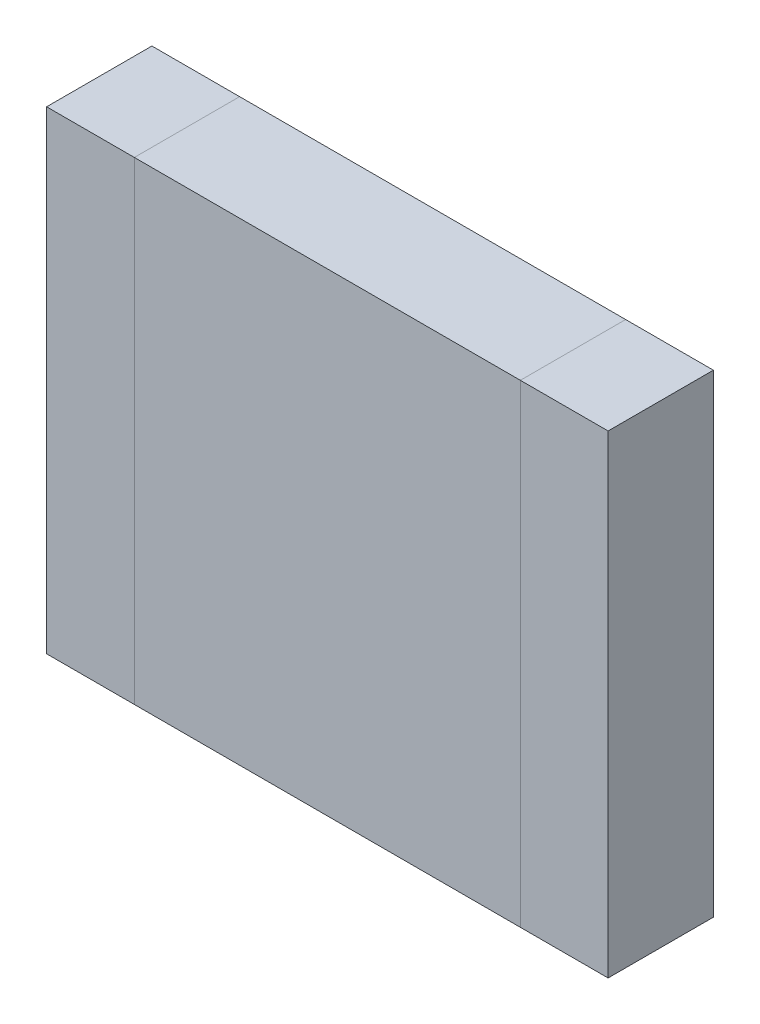
ISO-10303-21;
HEADER;
FILE_DESCRIPTION(('STEP AP214'),'2;1');
FILE_NAME('part.step','',(''),(''),'','','');
FILE_SCHEMA(('AUTOMOTIVE_DESIGN { 1 0 10303 214 1 1 1 1 }'));
ENDSEC;
DATA;
#1=APPLICATION_CONTEXT('core data for automotive mechanical design processes');
#2=APPLICATION_PROTOCOL_DEFINITION('international standard','automotive_design',2000,#1);
#3=PRODUCT_CONTEXT('',#1,'mechanical');
#4=PRODUCT('Part','Part','',(#3));
#5=PRODUCT_RELATED_PRODUCT_CATEGORY('part','',(#4));
#6=PRODUCT_DEFINITION_FORMATION('','',#4);
#7=PRODUCT_DEFINITION_CONTEXT('part definition',#1,'design');
#8=PRODUCT_DEFINITION('design','',#6,#7);
#9=PRODUCT_DEFINITION_SHAPE('','',#8);
#10=(LENGTH_UNIT() NAMED_UNIT(*) SI_UNIT(.MILLI.,.METRE.));
#11=(NAMED_UNIT(*) PLANE_ANGLE_UNIT() SI_UNIT($,.RADIAN.));
#12=(NAMED_UNIT(*) SI_UNIT($,.STERADIAN.) SOLID_ANGLE_UNIT());
#13=UNCERTAINTY_MEASURE_WITH_UNIT(LENGTH_MEASURE(1.E-05),#10,'distance_accuracy_value','');
#14=(GEOMETRIC_REPRESENTATION_CONTEXT(3) GLOBAL_UNCERTAINTY_ASSIGNED_CONTEXT((#13)) GLOBAL_UNIT_ASSIGNED_CONTEXT((#10,
#11,#12)) REPRESENTATION_CONTEXT('',''));
#15=CARTESIAN_POINT('',(0.,0.,0.));
#16=DIRECTION('',(0.,0.,1.));
#17=DIRECTION('',(1.,0.,0.));
#18=AXIS2_PLACEMENT_3D('',#15,#16,#17);
#19=CARTESIAN_POINT('',(1.0999978,1.34999984,0.));
#20=DIRECTION('',(1.,0.,0.));
#21=DIRECTION('',(0.,-1.,0.));
#22=AXIS2_PLACEMENT_3D('',#19,#20,#21);
#23=PLANE('',#22);
#24=DIRECTION('',(0.,-1.,0.));
#25=VECTOR('',#24,1.);
#26=CARTESIAN_POINT('',(1.0999978,1.34999984,0.));
#27=LINE('',#26,#25);
#28=CARTESIAN_POINT('',(1.0999978,1.34999984,0.));
#29=VERTEX_POINT('',#28);
#30=CARTESIAN_POINT('',(1.0999978,-1.34999984,0.));
#31=VERTEX_POINT('',#30);
#32=EDGE_CURVE('P0_E11',#29,#31,#27,.T.);
#33=ORIENTED_EDGE('',*,*,#32,.T.);
#34=DIRECTION('',(0.,0.,1.));
#35=VECTOR('',#34,1.);
#36=CARTESIAN_POINT('',(1.0999978,-1.34999984,0.));
#37=LINE('',#36,#35);
#38=CARTESIAN_POINT('',(1.0999978,-1.34999984,0.5999988));
#39=VERTEX_POINT('',#38);
#40=EDGE_CURVE('P0_E24',#31,#39,#37,.T.);
#41=ORIENTED_EDGE('',*,*,#40,.T.);
#42=DIRECTION('',(0.,-1.,0.));
#43=VECTOR('',#42,1.);
#44=CARTESIAN_POINT('',(1.0999978,1.34999984,0.5999988));
#45=LINE('',#44,#43);
#46=CARTESIAN_POINT('',(1.0999978,1.34999984,0.5999988));
#47=VERTEX_POINT('',#46);
#48=EDGE_CURVE('P0_E87',#47,#39,#45,.T.);
#49=ORIENTED_EDGE('',*,*,#48,.F.);
#50=DIRECTION('',(0.,0.,1.));
#51=VECTOR('',#50,1.);
#52=CARTESIAN_POINT('',(1.0999978,1.34999984,0.));
#53=LINE('',#52,#51);
#54=EDGE_CURVE('P0_E36',#29,#47,#53,.T.);
#55=ORIENTED_EDGE('',*,*,#54,.F.);
#56=EDGE_LOOP('',(#33,#41,#49,#55));
#57=FACE_BOUND('',#56,.T.);
#58=ADVANCED_FACE('P0_F17',(#57),#23,.F.);
#59=CARTESIAN_POINT('',(1.0999978,-1.34999984,0.));
#60=DIRECTION('',(0.,1.,0.));
#61=DIRECTION('',(1.,0.,0.));
#62=AXIS2_PLACEMENT_3D('',#59,#60,#61);
#63=PLANE('',#62);
#64=DIRECTION('',(1.,0.,0.));
#65=VECTOR('',#64,1.);
#66=CARTESIAN_POINT('',(1.0999978,-1.34999984,0.));
#67=LINE('',#66,#65);
#68=CARTESIAN_POINT('',(1.59999934,-1.34999984,0.));
#69=VERTEX_POINT('',#68);
#70=EDGE_CURVE('P0_E84',#31,#69,#67,.T.);
#71=ORIENTED_EDGE('',*,*,#70,.T.);
#72=DIRECTION('',(0.,0.,1.));
#73=VECTOR('',#72,1.);
#74=CARTESIAN_POINT('',(1.59999934,-1.34999984,0.));
#75=LINE('',#74,#73);
#76=CARTESIAN_POINT('',(1.59999934,-1.34999984,0.5999988));
#77=VERTEX_POINT('',#76);
#78=EDGE_CURVE('P0_E82',#69,#77,#75,.T.);
#79=ORIENTED_EDGE('',*,*,#78,.T.);
#80=DIRECTION('',(1.,0.,0.));
#81=VECTOR('',#80,1.);
#82=CARTESIAN_POINT('',(1.0999978,-1.34999984,0.5999988));
#83=LINE('',#82,#81);
#84=EDGE_CURVE('P0_E62',#39,#77,#83,.T.);
#85=ORIENTED_EDGE('',*,*,#84,.F.);
#86=ORIENTED_EDGE('',*,*,#40,.F.);
#87=EDGE_LOOP('',(#71,#79,#85,#86));
#88=FACE_BOUND('',#87,.T.);
#89=ADVANCED_FACE('P0_F89',(#88),#63,.F.);
#90=CARTESIAN_POINT('',(1.59999934,-1.34999984,0.));
#91=DIRECTION('',(-1.,0.,0.));
#92=DIRECTION('',(0.,1.,0.));
#93=AXIS2_PLACEMENT_3D('',#90,#91,#92);
#94=PLANE('',#93);
#95=DIRECTION('',(0.,1.,0.));
#96=VECTOR('',#95,1.);
#97=CARTESIAN_POINT('',(1.59999934,-1.34999984,0.));
#98=LINE('',#97,#96);
#99=CARTESIAN_POINT('',(1.59999934,1.34999984,0.));
#100=VERTEX_POINT('',#99);
#101=EDGE_CURVE('P0_E71',#69,#100,#98,.T.);
#102=ORIENTED_EDGE('',*,*,#101,.T.);
#103=DIRECTION('',(0.,0.,1.));
#104=VECTOR('',#103,1.);
#105=CARTESIAN_POINT('',(1.59999934,1.34999984,0.));
#106=LINE('',#105,#104);
#107=CARTESIAN_POINT('',(1.59999934,1.34999984,0.5999988));
#108=VERTEX_POINT('',#107);
#109=EDGE_CURVE('P0_E65',#100,#108,#106,.T.);
#110=ORIENTED_EDGE('',*,*,#109,.T.);
#111=DIRECTION('',(0.,1.,0.));
#112=VECTOR('',#111,1.);
#113=CARTESIAN_POINT('',(1.59999934,-1.34999984,0.5999988));
#114=LINE('',#113,#112);
#115=EDGE_CURVE('P0_E57',#77,#108,#114,.T.);
#116=ORIENTED_EDGE('',*,*,#115,.F.);
#117=ORIENTED_EDGE('',*,*,#78,.F.);
#118=EDGE_LOOP('',(#102,#110,#116,#117));
#119=FACE_BOUND('',#118,.T.);
#120=ADVANCED_FACE('P0_F69',(#119),#94,.F.);
#121=CARTESIAN_POINT('',(1.59999934,1.34999984,0.));
#122=DIRECTION('',(0.,-1.,0.));
#123=DIRECTION('',(-1.,0.,0.));
#124=AXIS2_PLACEMENT_3D('',#121,#122,#123);
#125=PLANE('',#124);
#126=DIRECTION('',(-1.,0.,0.));
#127=VECTOR('',#126,1.);
#128=CARTESIAN_POINT('',(1.59999934,1.34999984,0.));
#129=LINE('',#128,#127);
#130=EDGE_CURVE('P0_E66',#100,#29,#129,.T.);
#131=ORIENTED_EDGE('',*,*,#130,.T.);
#132=ORIENTED_EDGE('',*,*,#54,.T.);
#133=DIRECTION('',(-1.,0.,0.));
#134=VECTOR('',#133,1.);
#135=CARTESIAN_POINT('',(1.59999934,1.34999984,0.5999988));
#136=LINE('',#135,#134);
#137=EDGE_CURVE('P0_E61',#108,#47,#136,.T.);
#138=ORIENTED_EDGE('',*,*,#137,.F.);
#139=ORIENTED_EDGE('',*,*,#109,.F.);
#140=EDGE_LOOP('',(#131,#132,#138,#139));
#141=FACE_BOUND('',#140,.T.);
#142=ADVANCED_FACE('P0_F76',(#141),#125,.F.);
#143=CARTESIAN_POINT('',(1.34999857,0.,0.));
#144=DIRECTION('',(0.,0.,1.));
#145=DIRECTION('',(1.,0.,0.));
#146=AXIS2_PLACEMENT_3D('',#143,#144,#145);
#147=PLANE('',#146);
#148=ORIENTED_EDGE('',*,*,#130,.F.);
#149=ORIENTED_EDGE('',*,*,#101,.F.);
#150=ORIENTED_EDGE('',*,*,#70,.F.);
#151=ORIENTED_EDGE('',*,*,#32,.F.);
#152=EDGE_LOOP('',(#148,#149,#150,#151));
#153=FACE_BOUND('',#152,.T.);
#154=ADVANCED_FACE('P0_F91',(#153),#147,.F.);
#155=CARTESIAN_POINT('',(1.34999857,0.,0.5999988));
#156=DIRECTION('',(0.,0.,1.));
#157=DIRECTION('',(1.,0.,0.));
#158=AXIS2_PLACEMENT_3D('',#155,#156,#157);
#159=PLANE('',#158);
#160=ORIENTED_EDGE('',*,*,#48,.T.);
#161=ORIENTED_EDGE('',*,*,#84,.T.);
#162=ORIENTED_EDGE('',*,*,#115,.T.);
#163=ORIENTED_EDGE('',*,*,#137,.T.);
#164=EDGE_LOOP('',(#160,#161,#162,#163));
#165=FACE_BOUND('',#164,.T.);
#166=ADVANCED_FACE('P0_F59',(#165),#159,.T.);
#167=CLOSED_SHELL('',(#58,#89,#120,#142,#154,#166));
#168=MANIFOLD_SOLID_BREP('P0_B1',#167);
#169=CARTESIAN_POINT('',(-1.59999934,1.34999984,0.));
#170=DIRECTION('',(1.,0.,0.));
#171=DIRECTION('',(0.,-1.,0.));
#172=AXIS2_PLACEMENT_3D('',#169,#170,#171);
#173=PLANE('',#172);
#174=DIRECTION('',(0.,-1.,0.));
#175=VECTOR('',#174,1.);
#176=CARTESIAN_POINT('',(-1.59999934,1.34999984,0.));
#177=LINE('',#176,#175);
#178=CARTESIAN_POINT('',(-1.59999934,1.34999984,0.));
#179=VERTEX_POINT('',#178);
#180=CARTESIAN_POINT('',(-1.59999934,-1.34999984,0.));
#181=VERTEX_POINT('',#180);
#182=EDGE_CURVE('P1_E11',#179,#181,#177,.T.);
#183=ORIENTED_EDGE('',*,*,#182,.T.);
#184=DIRECTION('',(0.,0.,1.));
#185=VECTOR('',#184,1.);
#186=CARTESIAN_POINT('',(-1.59999934,-1.34999984,0.));
#187=LINE('',#186,#185);
#188=CARTESIAN_POINT('',(-1.59999934,-1.34999984,0.5999988));
#189=VERTEX_POINT('',#188);
#190=EDGE_CURVE('P1_E24',#181,#189,#187,.T.);
#191=ORIENTED_EDGE('',*,*,#190,.T.);
#192=DIRECTION('',(0.,-1.,0.));
#193=VECTOR('',#192,1.);
#194=CARTESIAN_POINT('',(-1.59999934,1.34999984,0.5999988));
#195=LINE('',#194,#193);
#196=CARTESIAN_POINT('',(-1.59999934,1.34999984,0.5999988));
#197=VERTEX_POINT('',#196);
#198=EDGE_CURVE('P1_E87',#197,#189,#195,.T.);
#199=ORIENTED_EDGE('',*,*,#198,.F.);
#200=DIRECTION('',(0.,0.,1.));
#201=VECTOR('',#200,1.);
#202=CARTESIAN_POINT('',(-1.59999934,1.34999984,0.));
#203=LINE('',#202,#201);
#204=EDGE_CURVE('P1_E36',#179,#197,#203,.T.);
#205=ORIENTED_EDGE('',*,*,#204,.F.);
#206=EDGE_LOOP('',(#183,#191,#199,#205));
#207=FACE_BOUND('',#206,.T.);
#208=ADVANCED_FACE('P1_F17',(#207),#173,.F.);
#209=CARTESIAN_POINT('',(-1.59999934,-1.34999984,0.));
#210=DIRECTION('',(0.,1.,0.));
#211=DIRECTION('',(1.,0.,0.));
#212=AXIS2_PLACEMENT_3D('',#209,#210,#211);
#213=PLANE('',#212);
#214=DIRECTION('',(1.,0.,0.));
#215=VECTOR('',#214,1.);
#216=CARTESIAN_POINT('',(-1.59999934,-1.34999984,0.));
#217=LINE('',#216,#215);
#218=CARTESIAN_POINT('',(-1.0999978,-1.34999984,0.));
#219=VERTEX_POINT('',#218);
#220=EDGE_CURVE('P1_E84',#181,#219,#217,.T.);
#221=ORIENTED_EDGE('',*,*,#220,.T.);
#222=DIRECTION('',(0.,0.,1.));
#223=VECTOR('',#222,1.);
#224=CARTESIAN_POINT('',(-1.0999978,-1.34999984,0.));
#225=LINE('',#224,#223);
#226=CARTESIAN_POINT('',(-1.0999978,-1.34999984,0.5999988));
#227=VERTEX_POINT('',#226);
#228=EDGE_CURVE('P1_E82',#219,#227,#225,.T.);
#229=ORIENTED_EDGE('',*,*,#228,.T.);
#230=DIRECTION('',(1.,0.,0.));
#231=VECTOR('',#230,1.);
#232=CARTESIAN_POINT('',(-1.59999934,-1.34999984,0.5999988));
#233=LINE('',#232,#231);
#234=EDGE_CURVE('P1_E62',#189,#227,#233,.T.);
#235=ORIENTED_EDGE('',*,*,#234,.F.);
#236=ORIENTED_EDGE('',*,*,#190,.F.);
#237=EDGE_LOOP('',(#221,#229,#235,#236));
#238=FACE_BOUND('',#237,.T.);
#239=ADVANCED_FACE('P1_F89',(#238),#213,.F.);
#240=CARTESIAN_POINT('',(-1.0999978,-1.34999984,0.));
#241=DIRECTION('',(-1.,0.,0.));
#242=DIRECTION('',(0.,1.,0.));
#243=AXIS2_PLACEMENT_3D('',#240,#241,#242);
#244=PLANE('',#243);
#245=DIRECTION('',(0.,1.,0.));
#246=VECTOR('',#245,1.);
#247=CARTESIAN_POINT('',(-1.0999978,-1.34999984,0.));
#248=LINE('',#247,#246);
#249=CARTESIAN_POINT('',(-1.0999978,1.34999984,0.));
#250=VERTEX_POINT('',#249);
#251=EDGE_CURVE('P1_E71',#219,#250,#248,.T.);
#252=ORIENTED_EDGE('',*,*,#251,.T.);
#253=DIRECTION('',(0.,0.,1.));
#254=VECTOR('',#253,1.);
#255=CARTESIAN_POINT('',(-1.0999978,1.34999984,0.));
#256=LINE('',#255,#254);
#257=CARTESIAN_POINT('',(-1.0999978,1.34999984,0.5999988));
#258=VERTEX_POINT('',#257);
#259=EDGE_CURVE('P1_E65',#250,#258,#256,.T.);
#260=ORIENTED_EDGE('',*,*,#259,.T.);
#261=DIRECTION('',(0.,1.,0.));
#262=VECTOR('',#261,1.);
#263=CARTESIAN_POINT('',(-1.0999978,-1.34999984,0.5999988));
#264=LINE('',#263,#262);
#265=EDGE_CURVE('P1_E57',#227,#258,#264,.T.);
#266=ORIENTED_EDGE('',*,*,#265,.F.);
#267=ORIENTED_EDGE('',*,*,#228,.F.);
#268=EDGE_LOOP('',(#252,#260,#266,#267));
#269=FACE_BOUND('',#268,.T.);
#270=ADVANCED_FACE('P1_F69',(#269),#244,.F.);
#271=CARTESIAN_POINT('',(-1.0999978,1.34999984,0.));
#272=DIRECTION('',(0.,-1.,0.));
#273=DIRECTION('',(-1.,0.,0.));
#274=AXIS2_PLACEMENT_3D('',#271,#272,#273);
#275=PLANE('',#274);
#276=DIRECTION('',(-1.,0.,0.));
#277=VECTOR('',#276,1.);
#278=CARTESIAN_POINT('',(-1.0999978,1.34999984,0.));
#279=LINE('',#278,#277);
#280=EDGE_CURVE('P1_E66',#250,#179,#279,.T.);
#281=ORIENTED_EDGE('',*,*,#280,.T.);
#282=ORIENTED_EDGE('',*,*,#204,.T.);
#283=DIRECTION('',(-1.,0.,0.));
#284=VECTOR('',#283,1.);
#285=CARTESIAN_POINT('',(-1.0999978,1.34999984,0.5999988));
#286=LINE('',#285,#284);
#287=EDGE_CURVE('P1_E61',#258,#197,#286,.T.);
#288=ORIENTED_EDGE('',*,*,#287,.F.);
#289=ORIENTED_EDGE('',*,*,#259,.F.);
#290=EDGE_LOOP('',(#281,#282,#288,#289));
#291=FACE_BOUND('',#290,.T.);
#292=ADVANCED_FACE('P1_F76',(#291),#275,.F.);
#293=CARTESIAN_POINT('',(-1.34999857,0.,0.));
#294=DIRECTION('',(0.,0.,1.));
#295=DIRECTION('',(1.,0.,0.));
#296=AXIS2_PLACEMENT_3D('',#293,#294,#295);
#297=PLANE('',#296);
#298=ORIENTED_EDGE('',*,*,#280,.F.);
#299=ORIENTED_EDGE('',*,*,#251,.F.);
#300=ORIENTED_EDGE('',*,*,#220,.F.);
#301=ORIENTED_EDGE('',*,*,#182,.F.);
#302=EDGE_LOOP('',(#298,#299,#300,#301));
#303=FACE_BOUND('',#302,.T.);
#304=ADVANCED_FACE('P1_F91',(#303),#297,.F.);
#305=CARTESIAN_POINT('',(-1.34999857,0.,0.5999988));
#306=DIRECTION('',(0.,0.,1.));
#307=DIRECTION('',(1.,0.,0.));
#308=AXIS2_PLACEMENT_3D('',#305,#306,#307);
#309=PLANE('',#308);
#310=ORIENTED_EDGE('',*,*,#198,.T.);
#311=ORIENTED_EDGE('',*,*,#234,.T.);
#312=ORIENTED_EDGE('',*,*,#265,.T.);
#313=ORIENTED_EDGE('',*,*,#287,.T.);
#314=EDGE_LOOP('',(#310,#311,#312,#313));
#315=FACE_BOUND('',#314,.T.);
#316=ADVANCED_FACE('P1_F59',(#315),#309,.T.);
#317=CLOSED_SHELL('',(#208,#239,#270,#292,#304,#316));
#318=MANIFOLD_SOLID_BREP('P1_B1',#317);
#319=CARTESIAN_POINT('',(-1.0999978,1.34999984,0.));
#320=DIRECTION('',(1.,0.,0.));
#321=DIRECTION('',(0.,-1.,0.));
#322=AXIS2_PLACEMENT_3D('',#319,#320,#321);
#323=PLANE('',#322);
#324=DIRECTION('',(0.,-1.,0.));
#325=VECTOR('',#324,1.);
#326=CARTESIAN_POINT('',(-1.0999978,1.34999984,0.));
#327=LINE('',#326,#325);
#328=CARTESIAN_POINT('',(-1.0999978,1.34999984,0.));
#329=VERTEX_POINT('',#328);
#330=CARTESIAN_POINT('',(-1.0999978,-1.34999984,0.));
#331=VERTEX_POINT('',#330);
#332=EDGE_CURVE('P2_E10',#329,#331,#327,.T.);
#333=ORIENTED_EDGE('',*,*,#332,.T.);
#334=DIRECTION('',(0.,0.,1.));
#335=VECTOR('',#334,1.);
#336=CARTESIAN_POINT('',(-1.0999978,-1.34999984,0.));
#337=LINE('',#336,#335);
#338=CARTESIAN_POINT('',(-1.0999978,-1.34999984,0.5999988));
#339=VERTEX_POINT('',#338);
#340=EDGE_CURVE('P2_E23',#331,#339,#337,.T.);
#341=ORIENTED_EDGE('',*,*,#340,.T.);
#342=DIRECTION('',(0.,-1.,0.));
#343=VECTOR('',#342,1.);
#344=CARTESIAN_POINT('',(-1.0999978,1.34999984,0.5999988));
#345=LINE('',#344,#343);
#346=CARTESIAN_POINT('',(-1.0999978,1.34999984,0.5999988));
#347=VERTEX_POINT('',#346);
#348=EDGE_CURVE('P2_E86',#347,#339,#345,.T.);
#349=ORIENTED_EDGE('',*,*,#348,.F.);
#350=DIRECTION('',(0.,0.,1.));
#351=VECTOR('',#350,1.);
#352=CARTESIAN_POINT('',(-1.0999978,1.34999984,0.));
#353=LINE('',#352,#351);
#354=EDGE_CURVE('P2_E37',#329,#347,#353,.T.);
#355=ORIENTED_EDGE('',*,*,#354,.F.);
#356=EDGE_LOOP('',(#333,#341,#349,#355));
#357=FACE_BOUND('',#356,.T.);
#358=ADVANCED_FACE('P2_F16',(#357),#323,.F.);
#359=CARTESIAN_POINT('',(-1.0999978,-1.34999984,0.));
#360=DIRECTION('',(0.,1.,0.));
#361=DIRECTION('',(1.,0.,0.));
#362=AXIS2_PLACEMENT_3D('',#359,#360,#361);
#363=PLANE('',#362);
#364=DIRECTION('',(1.,0.,0.));
#365=VECTOR('',#364,1.);
#366=CARTESIAN_POINT('',(-1.0999978,-1.34999984,0.));
#367=LINE('',#366,#365);
#368=CARTESIAN_POINT('',(1.10000034,-1.34999984,0.));
#369=VERTEX_POINT('',#368);
#370=EDGE_CURVE('P2_E30',#331,#369,#367,.T.);
#371=ORIENTED_EDGE('',*,*,#370,.T.);
#372=DIRECTION('',(0.,0.,1.));
#373=VECTOR('',#372,1.);
#374=CARTESIAN_POINT('',(1.10000034,-1.34999984,0.));
#375=LINE('',#374,#373);
#376=CARTESIAN_POINT('',(1.10000034,-1.34999984,0.5999988));
#377=VERTEX_POINT('',#376);
#378=EDGE_CURVE('P2_E82',#369,#377,#375,.T.);
#379=ORIENTED_EDGE('',*,*,#378,.T.);
#380=DIRECTION('',(1.,0.,0.));
#381=VECTOR('',#380,1.);
#382=CARTESIAN_POINT('',(-1.0999978,-1.34999984,0.5999988));
#383=LINE('',#382,#381);
#384=EDGE_CURVE('P2_E62',#339,#377,#383,.T.);
#385=ORIENTED_EDGE('',*,*,#384,.F.);
#386=ORIENTED_EDGE('',*,*,#340,.F.);
#387=EDGE_LOOP('',(#371,#379,#385,#386));
#388=FACE_BOUND('',#387,.T.);
#389=ADVANCED_FACE('P2_F89',(#388),#363,.F.);
#390=CARTESIAN_POINT('',(1.10000034,-1.34999984,0.));
#391=DIRECTION('',(-1.,0.,0.));
#392=DIRECTION('',(0.,1.,0.));
#393=AXIS2_PLACEMENT_3D('',#390,#391,#392);
#394=PLANE('',#393);
#395=DIRECTION('',(0.,1.,0.));
#396=VECTOR('',#395,1.);
#397=CARTESIAN_POINT('',(1.10000034,-1.34999984,0.));
#398=LINE('',#397,#396);
#399=CARTESIAN_POINT('',(1.10000034,1.34999984,0.));
#400=VERTEX_POINT('',#399);
#401=EDGE_CURVE('P2_E71',#369,#400,#398,.T.);
#402=ORIENTED_EDGE('',*,*,#401,.T.);
#403=DIRECTION('',(0.,0.,1.));
#404=VECTOR('',#403,1.);
#405=CARTESIAN_POINT('',(1.10000034,1.34999984,0.));
#406=LINE('',#405,#404);
#407=CARTESIAN_POINT('',(1.10000034,1.34999984,0.5999988));
#408=VERTEX_POINT('',#407);
#409=EDGE_CURVE('P2_E66',#400,#408,#406,.T.);
#410=ORIENTED_EDGE('',*,*,#409,.T.);
#411=DIRECTION('',(0.,1.,0.));
#412=VECTOR('',#411,1.);
#413=CARTESIAN_POINT('',(1.10000034,-1.34999984,0.5999988));
#414=LINE('',#413,#412);
#415=EDGE_CURVE('P2_E56',#377,#408,#414,.T.);
#416=ORIENTED_EDGE('',*,*,#415,.F.);
#417=ORIENTED_EDGE('',*,*,#378,.F.);
#418=EDGE_LOOP('',(#402,#410,#416,#417));
#419=FACE_BOUND('',#418,.T.);
#420=ADVANCED_FACE('P2_F70',(#419),#394,.F.);
#421=CARTESIAN_POINT('',(1.10000034,1.34999984,0.));
#422=DIRECTION('',(0.,-1.,0.));
#423=DIRECTION('',(-1.,0.,0.));
#424=AXIS2_PLACEMENT_3D('',#421,#422,#423);
#425=PLANE('',#424);
#426=DIRECTION('',(-1.,0.,0.));
#427=VECTOR('',#426,1.);
#428=CARTESIAN_POINT('',(1.10000034,1.34999984,0.));
#429=LINE('',#428,#427);
#430=EDGE_CURVE('P2_E67',#400,#329,#429,.T.);
#431=ORIENTED_EDGE('',*,*,#430,.T.);
#432=ORIENTED_EDGE('',*,*,#354,.T.);
#433=DIRECTION('',(-1.,0.,0.));
#434=VECTOR('',#433,1.);
#435=CARTESIAN_POINT('',(1.10000034,1.34999984,0.5999988));
#436=LINE('',#435,#434);
#437=EDGE_CURVE('P2_E60',#408,#347,#436,.T.);
#438=ORIENTED_EDGE('',*,*,#437,.F.);
#439=ORIENTED_EDGE('',*,*,#409,.F.);
#440=EDGE_LOOP('',(#431,#432,#438,#439));
#441=FACE_BOUND('',#440,.T.);
#442=ADVANCED_FACE('P2_F76',(#441),#425,.F.);
#443=CARTESIAN_POINT('',(1.270000012781E-06,0.,0.));
#444=DIRECTION('',(0.,0.,1.));
#445=DIRECTION('',(1.,0.,0.));
#446=AXIS2_PLACEMENT_3D('',#443,#444,#445);
#447=PLANE('',#446);
#448=ORIENTED_EDGE('',*,*,#430,.F.);
#449=ORIENTED_EDGE('',*,*,#401,.F.);
#450=ORIENTED_EDGE('',*,*,#370,.F.);
#451=ORIENTED_EDGE('',*,*,#332,.F.);
#452=EDGE_LOOP('',(#448,#449,#450,#451));
#453=FACE_BOUND('',#452,.T.);
#454=ADVANCED_FACE('P2_F90',(#453),#447,.F.);
#455=CARTESIAN_POINT('',(1.270000012781E-06,0.,0.5999988));
#456=DIRECTION('',(0.,0.,1.));
#457=DIRECTION('',(1.,0.,0.));
#458=AXIS2_PLACEMENT_3D('',#455,#456,#457);
#459=PLANE('',#458);
#460=ORIENTED_EDGE('',*,*,#348,.T.);
#461=ORIENTED_EDGE('',*,*,#384,.T.);
#462=ORIENTED_EDGE('',*,*,#415,.T.);
#463=ORIENTED_EDGE('',*,*,#437,.T.);
#464=EDGE_LOOP('',(#460,#461,#462,#463));
#465=FACE_BOUND('',#464,.T.);
#466=ADVANCED_FACE('P2_F58',(#465),#459,.T.);
#467=CLOSED_SHELL('',(#358,#389,#420,#442,#454,#466));
#468=MANIFOLD_SOLID_BREP('P2_B1',#467);
#469=ADVANCED_BREP_SHAPE_REPRESENTATION('',(#18,#168,#318,#468),#14);
#470=SHAPE_DEFINITION_REPRESENTATION(#9,#469);
ENDSEC;
END-ISO-10303-21;
